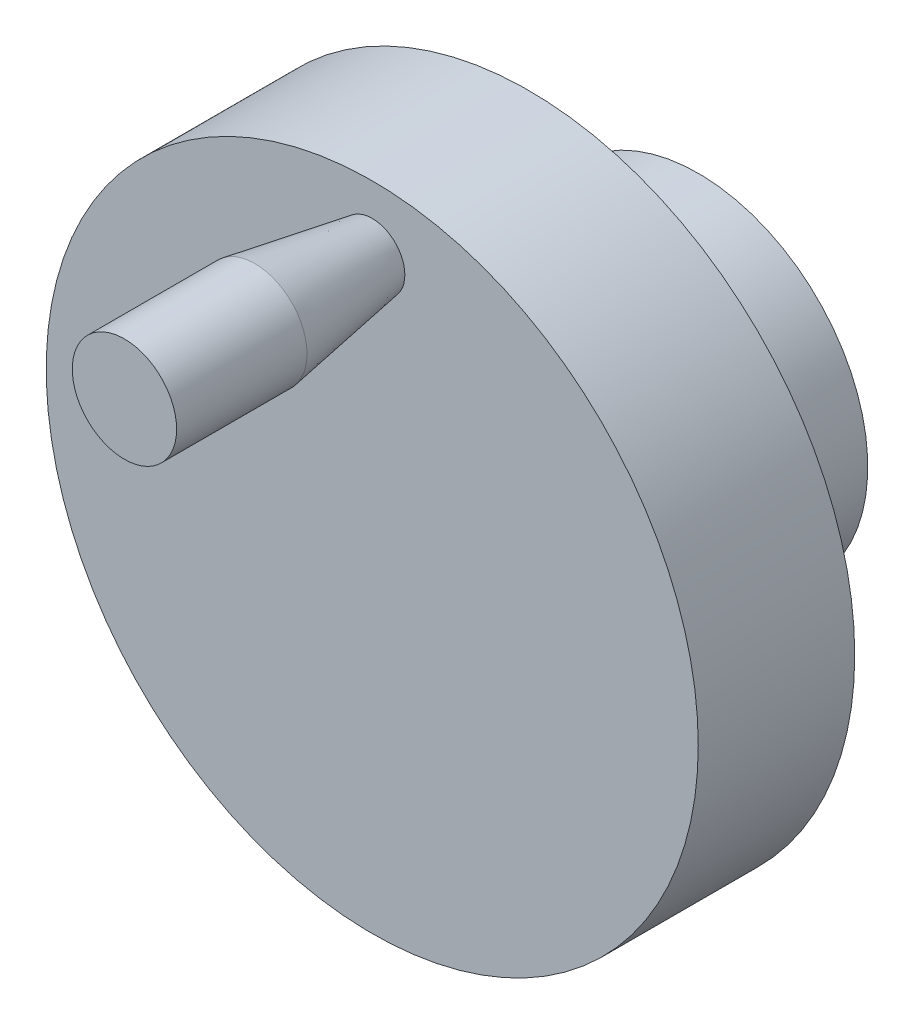
ISO-10303-21;
HEADER;
FILE_DESCRIPTION(('STEP AP214'),'2;1');
FILE_NAME('part.step','',(''),(''),'','','');
FILE_SCHEMA(('AUTOMOTIVE_DESIGN { 1 0 10303 214 1 1 1 1 }'));
ENDSEC;
DATA;
#1=APPLICATION_CONTEXT('core data for automotive mechanical design processes');
#2=APPLICATION_PROTOCOL_DEFINITION('international standard','automotive_design',2000,#1);
#3=PRODUCT_CONTEXT('',#1,'mechanical');
#4=PRODUCT('Part','Part','',(#3));
#5=PRODUCT_RELATED_PRODUCT_CATEGORY('part','',(#4));
#6=PRODUCT_DEFINITION_FORMATION('','',#4);
#7=PRODUCT_DEFINITION_CONTEXT('part definition',#1,'design');
#8=PRODUCT_DEFINITION('design','',#6,#7);
#9=PRODUCT_DEFINITION_SHAPE('','',#8);
#10=(LENGTH_UNIT() NAMED_UNIT(*) SI_UNIT(.MILLI.,.METRE.));
#11=(NAMED_UNIT(*) PLANE_ANGLE_UNIT() SI_UNIT($,.RADIAN.));
#12=(NAMED_UNIT(*) SI_UNIT($,.STERADIAN.) SOLID_ANGLE_UNIT());
#13=UNCERTAINTY_MEASURE_WITH_UNIT(LENGTH_MEASURE(1.E-05),#10,'distance_accuracy_value','');
#14=(GEOMETRIC_REPRESENTATION_CONTEXT(3) GLOBAL_UNCERTAINTY_ASSIGNED_CONTEXT((#13)) GLOBAL_UNIT_ASSIGNED_CONTEXT((#10,
#11,#12)) REPRESENTATION_CONTEXT('',''));
#15=CARTESIAN_POINT('',(0.,0.,0.));
#16=DIRECTION('',(0.,0.,1.));
#17=DIRECTION('',(1.,0.,0.));
#18=AXIS2_PLACEMENT_3D('',#15,#16,#17);
#19=CARTESIAN_POINT('',(0.,0.,12.));
#20=DIRECTION('',(0.,0.,-1.));
#21=DIRECTION('',(-1.,0.,0.));
#22=AXIS2_PLACEMENT_3D('',#19,#20,#21);
#23=CYLINDRICAL_SURFACE('',#22,25.);
#24=CARTESIAN_POINT('',(0.,0.,12.));
#25=DIRECTION('',(0.,0.,1.));
#26=DIRECTION('',(1.,0.,0.));
#27=AXIS2_PLACEMENT_3D('',#24,#25,#26);
#28=CIRCLE('',#27,25.);
#29=CARTESIAN_POINT('',(25.,0.,12.));
#30=VERTEX_POINT('',#29);
#31=EDGE_CURVE('E37',#30,#30,#28,.T.);
#32=ORIENTED_EDGE('',*,*,#31,.F.);
#33=EDGE_LOOP('',(#32));
#34=FACE_BOUND('',#33,.T.);
#35=CARTESIAN_POINT('',(0.,0.,0.));
#36=DIRECTION('',(0.,0.,1.));
#37=DIRECTION('',(1.,0.,0.));
#38=AXIS2_PLACEMENT_3D('',#35,#36,#37);
#39=CIRCLE('',#38,25.);
#40=CARTESIAN_POINT('',(25.,0.,0.));
#41=VERTEX_POINT('',#40);
#42=EDGE_CURVE('E33',#41,#41,#39,.T.);
#43=ORIENTED_EDGE('',*,*,#42,.T.);
#44=EDGE_LOOP('',(#43));
#45=FACE_BOUND('',#44,.T.);
#46=ADVANCED_FACE('F30',(#34,#45),#23,.T.);
#47=CARTESIAN_POINT('',(0.,0.,12.));
#48=DIRECTION('',(0.,0.,1.));
#49=DIRECTION('',(1.,0.,0.));
#50=AXIS2_PLACEMENT_3D('',#47,#48,#49);
#51=PLANE('',#50);
#52=CARTESIAN_POINT('',(0.,20.,12.));
#53=DIRECTION('',(0.,0.,1.));
#54=DIRECTION('',(1.,0.,0.));
#55=AXIS2_PLACEMENT_3D('',#52,#53,#54);
#56=CIRCLE('',#55,2.5);
#57=CARTESIAN_POINT('',(2.5,20.,12.));
#58=VERTEX_POINT('',#57);
#59=EDGE_CURVE('E52',#58,#58,#56,.T.);
#60=ORIENTED_EDGE('',*,*,#59,.F.);
#61=EDGE_LOOP('',(#60));
#62=FACE_BOUND('',#61,.T.);
#63=ORIENTED_EDGE('',*,*,#31,.T.);
#64=EDGE_LOOP('',(#63));
#65=FACE_BOUND('',#64,.T.);
#66=ADVANCED_FACE('F77',(#62,#65),#51,.T.);
#67=CARTESIAN_POINT('',(0.,0.,0.));
#68=DIRECTION('',(0.,0.,1.));
#69=DIRECTION('',(1.,0.,0.));
#70=AXIS2_PLACEMENT_3D('',#67,#68,#69);
#71=PLANE('',#70);
#72=CARTESIAN_POINT('',(0.,0.,0.));
#73=DIRECTION('',(0.,0.,-1.));
#74=DIRECTION('',(-1.,0.,0.));
#75=AXIS2_PLACEMENT_3D('',#72,#73,#74);
#76=CIRCLE('',#75,13.);
#77=CARTESIAN_POINT('',(-13.,0.,0.));
#78=VERTEX_POINT('',#77);
#79=EDGE_CURVE('E10',#78,#78,#76,.T.);
#80=ORIENTED_EDGE('',*,*,#79,.F.);
#81=EDGE_LOOP('',(#80));
#82=FACE_BOUND('',#81,.T.);
#83=ORIENTED_EDGE('',*,*,#42,.F.);
#84=EDGE_LOOP('',(#83));
#85=FACE_BOUND('',#84,.T.);
#86=ADVANCED_FACE('F80',(#82,#85),#71,.F.);
#87=CARTESIAN_POINT('',(0.,0.,-13.));
#88=DIRECTION('',(0.,0.,1.));
#89=DIRECTION('',(1.,0.,0.));
#90=AXIS2_PLACEMENT_3D('',#87,#88,#89);
#91=CYLINDRICAL_SURFACE('',#90,13.);
#92=CARTESIAN_POINT('',(0.,0.,-13.));
#93=DIRECTION('',(0.,0.,-1.));
#94=DIRECTION('',(-1.,0.,0.));
#95=AXIS2_PLACEMENT_3D('',#92,#93,#94);
#96=CIRCLE('',#95,13.);
#97=CARTESIAN_POINT('',(-13.,0.,-13.));
#98=VERTEX_POINT('',#97);
#99=EDGE_CURVE('E43',#98,#98,#96,.T.);
#100=ORIENTED_EDGE('',*,*,#99,.F.);
#101=EDGE_LOOP('',(#100));
#102=FACE_BOUND('',#101,.T.);
#103=ORIENTED_EDGE('',*,*,#79,.T.);
#104=EDGE_LOOP('',(#103));
#105=FACE_BOUND('',#104,.T.);
#106=ADVANCED_FACE('F90',(#102,#105),#91,.T.);
#107=CARTESIAN_POINT('',(0.,0.,-13.));
#108=DIRECTION('',(0.,0.,-1.));
#109=DIRECTION('',(-1.,0.,0.));
#110=AXIS2_PLACEMENT_3D('',#107,#108,#109);
#111=PLANE('',#110);
#112=CARTESIAN_POINT('',(0.,0.,-13.));
#113=DIRECTION('',(0.,0.,-1.));
#114=DIRECTION('',(-1.,0.,0.));
#115=AXIS2_PLACEMENT_3D('',#112,#113,#114);
#116=CIRCLE('',#115,4.);
#117=CARTESIAN_POINT('',(-4.,0.,-13.));
#118=VERTEX_POINT('',#117);
#119=EDGE_CURVE('E49',#118,#118,#116,.T.);
#120=ORIENTED_EDGE('',*,*,#119,.F.);
#121=EDGE_LOOP('',(#120));
#122=FACE_BOUND('',#121,.T.);
#123=ORIENTED_EDGE('',*,*,#99,.T.);
#124=EDGE_LOOP('',(#123));
#125=FACE_BOUND('',#124,.T.);
#126=ADVANCED_FACE('F95',(#122,#125),#111,.T.);
#127=CARTESIAN_POINT('',(0.,0.,0.));
#128=DIRECTION('',(0.,0.,1.));
#129=DIRECTION('',(1.,0.,0.));
#130=AXIS2_PLACEMENT_3D('',#127,#128,#129);
#131=PLANE('',#130);
#132=CARTESIAN_POINT('',(0.,0.,0.));
#133=DIRECTION('',(0.,0.,1.));
#134=DIRECTION('',(1.,0.,0.));
#135=AXIS2_PLACEMENT_3D('',#132,#133,#134);
#136=CIRCLE('',#135,4.);
#137=CARTESIAN_POINT('',(4.,0.,0.));
#138=VERTEX_POINT('',#137);
#139=EDGE_CURVE('E46',#138,#138,#136,.F.);
#140=ORIENTED_EDGE('',*,*,#139,.T.);
#141=EDGE_LOOP('',(#140));
#142=FACE_BOUND('',#141,.T.);
#143=ADVANCED_FACE('F101',(#142),#131,.F.);
#144=CARTESIAN_POINT('',(0.,0.,11.3137084989848));
#145=DIRECTION('',(0.,0.,-1.));
#146=DIRECTION('',(-1.,0.,0.));
#147=AXIS2_PLACEMENT_3D('',#144,#145,#146);
#148=CYLINDRICAL_SURFACE('',#147,4.);
#149=ORIENTED_EDGE('',*,*,#119,.T.);
#150=EDGE_LOOP('',(#149));
#151=FACE_BOUND('',#150,.T.);
#152=ORIENTED_EDGE('',*,*,#139,.F.);
#153=EDGE_LOOP('',(#152));
#154=FACE_BOUND('',#153,.T.);
#155=ADVANCED_FACE('F73',(#151,#154),#148,.F.);
#156=CARTESIAN_POINT('',(0.,20.,12.));
#157=DIRECTION('',(0.,0.,1.));
#158=DIRECTION('',(1.,0.,0.));
#159=AXIS2_PLACEMENT_3D('',#156,#157,#158);
#160=CONICAL_SURFACE('',#159,2.5,0.165148677414627);
#161=CARTESIAN_POINT('',(0.,20.,21.));
#162=DIRECTION('',(0.,0.,1.));
#163=DIRECTION('',(1.,0.,0.));
#164=AXIS2_PLACEMENT_3D('',#161,#162,#163);
#165=CIRCLE('',#164,4.);
#166=CARTESIAN_POINT('',(4.,20.,21.));
#167=VERTEX_POINT('',#166);
#168=EDGE_CURVE('E55',#167,#167,#165,.T.);
#169=ORIENTED_EDGE('',*,*,#168,.F.);
#170=EDGE_LOOP('',(#169));
#171=FACE_BOUND('',#170,.T.);
#172=ORIENTED_EDGE('',*,*,#59,.T.);
#173=EDGE_LOOP('',(#172));
#174=FACE_BOUND('',#173,.T.);
#175=ADVANCED_FACE('F67',(#171,#174),#160,.T.);
#176=CARTESIAN_POINT('',(0.,20.,31.));
#177=DIRECTION('',(0.,0.,1.));
#178=DIRECTION('',(1.,0.,0.));
#179=AXIS2_PLACEMENT_3D('',#176,#177,#178);
#180=CYLINDRICAL_SURFACE('',#179,4.);
#181=CARTESIAN_POINT('',(0.,20.,31.));
#182=DIRECTION('',(0.,0.,1.));
#183=DIRECTION('',(1.,0.,0.));
#184=AXIS2_PLACEMENT_3D('',#181,#182,#183);
#185=CIRCLE('',#184,4.);
#186=CARTESIAN_POINT('',(4.,20.,31.));
#187=VERTEX_POINT('',#186);
#188=EDGE_CURVE('E58',#187,#187,#185,.T.);
#189=ORIENTED_EDGE('',*,*,#188,.F.);
#190=EDGE_LOOP('',(#189));
#191=FACE_BOUND('',#190,.T.);
#192=ORIENTED_EDGE('',*,*,#168,.T.);
#193=EDGE_LOOP('',(#192));
#194=FACE_BOUND('',#193,.T.);
#195=ADVANCED_FACE('F64',(#191,#194),#180,.T.);
#196=CARTESIAN_POINT('',(0.,24.,31.));
#197=DIRECTION('',(0.,0.,-1.));
#198=DIRECTION('',(-1.,0.,0.));
#199=AXIS2_PLACEMENT_3D('',#196,#197,#198);
#200=PLANE('',#199);
#201=ORIENTED_EDGE('',*,*,#188,.T.);
#202=EDGE_LOOP('',(#201));
#203=FACE_BOUND('',#202,.T.);
#204=ADVANCED_FACE('F62',(#203),#200,.F.);
#205=CLOSED_SHELL('',(#46,#66,#86,#106,#126,#143,#155,#175,#195,#204));
#206=MANIFOLD_SOLID_BREP('B2',#205);
#207=ADVANCED_BREP_SHAPE_REPRESENTATION('',(#18,#206),#14);
#208=SHAPE_DEFINITION_REPRESENTATION(#9,#207);
ENDSEC;
END-ISO-10303-21;
